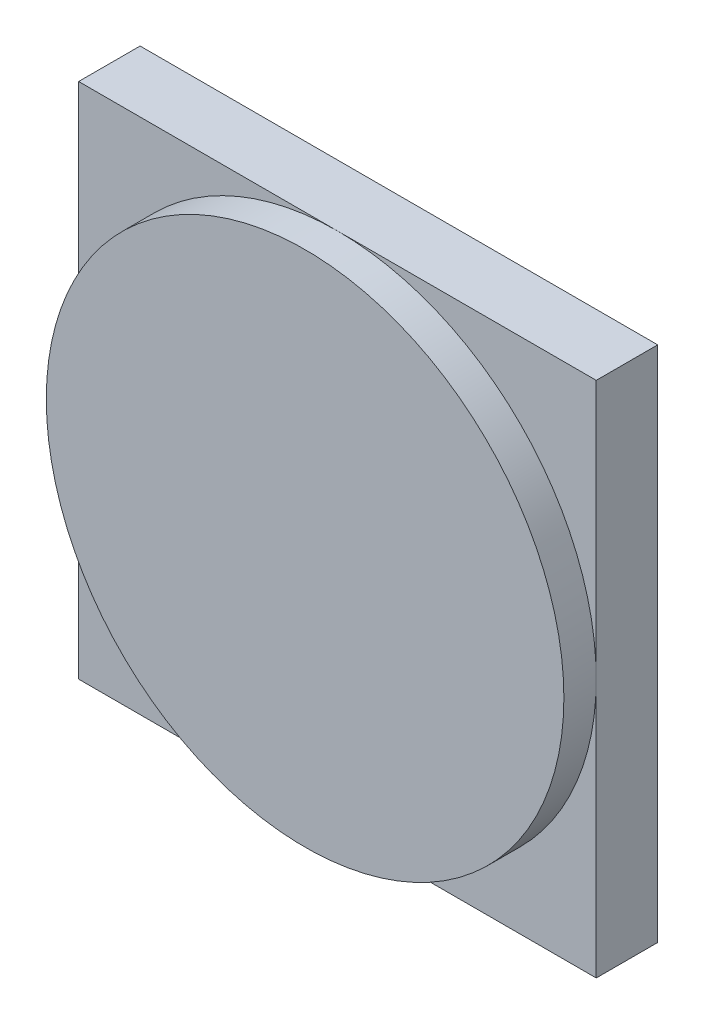
ISO-10303-21;
HEADER;
FILE_DESCRIPTION(('STEP AP214'),'2;1');
FILE_NAME('part.step','',(''),(''),'','','');
FILE_SCHEMA(('AUTOMOTIVE_DESIGN { 1 0 10303 214 1 1 1 1 }'));
ENDSEC;
DATA;
#1=APPLICATION_CONTEXT('core data for automotive mechanical design processes');
#2=APPLICATION_PROTOCOL_DEFINITION('international standard','automotive_design',2000,#1);
#3=PRODUCT_CONTEXT('',#1,'mechanical');
#4=PRODUCT('Part','Part','',(#3));
#5=PRODUCT_RELATED_PRODUCT_CATEGORY('part','',(#4));
#6=PRODUCT_DEFINITION_FORMATION('','',#4);
#7=PRODUCT_DEFINITION_CONTEXT('part definition',#1,'design');
#8=PRODUCT_DEFINITION('design','',#6,#7);
#9=PRODUCT_DEFINITION_SHAPE('','',#8);
#10=(LENGTH_UNIT() NAMED_UNIT(*) SI_UNIT(.MILLI.,.METRE.));
#11=(NAMED_UNIT(*) PLANE_ANGLE_UNIT() SI_UNIT($,.RADIAN.));
#12=(NAMED_UNIT(*) SI_UNIT($,.STERADIAN.) SOLID_ANGLE_UNIT());
#13=UNCERTAINTY_MEASURE_WITH_UNIT(LENGTH_MEASURE(1.E-05),#10,'distance_accuracy_value','');
#14=(GEOMETRIC_REPRESENTATION_CONTEXT(3) GLOBAL_UNCERTAINTY_ASSIGNED_CONTEXT((#13)) GLOBAL_UNIT_ASSIGNED_CONTEXT((#10,
#11,#12)) REPRESENTATION_CONTEXT('',''));
#15=CARTESIAN_POINT('',(0.,0.,0.));
#16=DIRECTION('',(0.,0.,1.));
#17=DIRECTION('',(1.,0.,0.));
#18=AXIS2_PLACEMENT_3D('',#15,#16,#17);
#19=CARTESIAN_POINT('',(0.,0.,5.));
#20=DIRECTION('',(0.,0.,-1.));
#21=DIRECTION('',(-1.,0.,0.));
#22=AXIS2_PLACEMENT_3D('',#19,#20,#21);
#23=CYLINDRICAL_SURFACE('',#22,40.);
#24=CARTESIAN_POINT('',(0.,0.,5.));
#25=DIRECTION('',(0.,0.,1.));
#26=DIRECTION('',(1.,0.,0.));
#27=AXIS2_PLACEMENT_3D('',#24,#25,#26);
#28=CIRCLE('',#27,40.);
#29=CARTESIAN_POINT('',(40.,0.,5.));
#30=VERTEX_POINT('',#29);
#31=EDGE_CURVE('E11',#30,#30,#28,.T.);
#32=ORIENTED_EDGE('',*,*,#31,.F.);
#33=EDGE_LOOP('',(#32));
#34=FACE_BOUND('',#33,.T.);
#35=CARTESIAN_POINT('',(0.,0.,0.));
#36=DIRECTION('',(0.,0.,1.));
#37=DIRECTION('',(1.,0.,0.));
#38=AXIS2_PLACEMENT_3D('',#35,#36,#37);
#39=CIRCLE('',#38,40.);
#40=CARTESIAN_POINT('',(40.,0.,0.));
#41=VERTEX_POINT('',#40);
#42=CARTESIAN_POINT('',(0.,40.,0.));
#43=VERTEX_POINT('',#42);
#44=EDGE_CURVE('E47',#41,#43,#39,.T.);
#45=ORIENTED_EDGE('',*,*,#44,.T.);
#46=CARTESIAN_POINT('',(-40.,0.,0.));
#47=VERTEX_POINT('',#46);
#48=EDGE_CURVE('E66',#43,#47,#39,.T.);
#49=ORIENTED_EDGE('',*,*,#48,.T.);
#50=CARTESIAN_POINT('',(0.,-40.,0.));
#51=VERTEX_POINT('',#50);
#52=EDGE_CURVE('E126',#47,#51,#39,.T.);
#53=ORIENTED_EDGE('',*,*,#52,.T.);
#54=EDGE_CURVE('E123',#51,#41,#39,.T.);
#55=ORIENTED_EDGE('',*,*,#54,.T.);
#56=EDGE_LOOP('',(#45,#49,#53,#55));
#57=FACE_BOUND('',#56,.T.);
#58=ADVANCED_FACE('F44',(#34,#57),#23,.T.);
#59=CARTESIAN_POINT('',(0.,0.,5.));
#60=DIRECTION('',(0.,0.,1.));
#61=DIRECTION('',(1.,0.,0.));
#62=AXIS2_PLACEMENT_3D('',#59,#60,#61);
#63=PLANE('',#62);
#64=ORIENTED_EDGE('',*,*,#31,.T.);
#65=EDGE_LOOP('',(#64));
#66=FACE_BOUND('',#65,.T.);
#67=ADVANCED_FACE('F162',(#66),#63,.T.);
#68=CARTESIAN_POINT('',(0.,0.,0.));
#69=DIRECTION('',(0.,0.,-1.));
#70=DIRECTION('',(-1.,0.,0.));
#71=AXIS2_PLACEMENT_3D('',#68,#69,#70);
#72=PLANE('',#71);
#73=ORIENTED_EDGE('',*,*,#44,.F.);
#74=DIRECTION('',(0.,-1.,0.));
#75=VECTOR('',#74,1.);
#76=CARTESIAN_POINT('',(40.,-40.,0.));
#77=LINE('',#76,#75);
#78=CARTESIAN_POINT('',(40.,40.,0.));
#79=VERTEX_POINT('',#78);
#80=EDGE_CURVE('E58',#79,#41,#77,.T.);
#81=ORIENTED_EDGE('',*,*,#80,.F.);
#82=DIRECTION('',(1.,0.,0.));
#83=VECTOR('',#82,1.);
#84=CARTESIAN_POINT('',(-40.,40.,0.));
#85=LINE('',#84,#83);
#86=EDGE_CURVE('E141',#43,#79,#85,.T.);
#87=ORIENTED_EDGE('',*,*,#86,.F.);
#88=EDGE_LOOP('',(#73,#81,#87));
#89=FACE_BOUND('',#88,.T.);
#90=ADVANCED_FACE('F160',(#89),#72,.F.);
#91=ORIENTED_EDGE('',*,*,#48,.F.);
#92=CARTESIAN_POINT('',(-40.,40.,0.));
#93=VERTEX_POINT('',#92);
#94=EDGE_CURVE('E139',#93,#43,#85,.T.);
#95=ORIENTED_EDGE('',*,*,#94,.F.);
#96=DIRECTION('',(0.,1.,0.));
#97=VECTOR('',#96,1.);
#98=CARTESIAN_POINT('',(-40.,-40.,0.));
#99=LINE('',#98,#97);
#100=EDGE_CURVE('E122',#47,#93,#99,.T.);
#101=ORIENTED_EDGE('',*,*,#100,.F.);
#102=EDGE_LOOP('',(#91,#95,#101));
#103=FACE_BOUND('',#102,.T.);
#104=ADVANCED_FACE('F156',(#103),#72,.F.);
#105=ORIENTED_EDGE('',*,*,#52,.F.);
#106=CARTESIAN_POINT('',(-40.,-40.,0.));
#107=VERTEX_POINT('',#106);
#108=EDGE_CURVE('E142',#107,#47,#99,.T.);
#109=ORIENTED_EDGE('',*,*,#108,.F.);
#110=DIRECTION('',(-1.,0.,0.));
#111=VECTOR('',#110,1.);
#112=CARTESIAN_POINT('',(-40.,-40.,0.));
#113=LINE('',#112,#111);
#114=EDGE_CURVE('E136',#51,#107,#113,.T.);
#115=ORIENTED_EDGE('',*,*,#114,.F.);
#116=EDGE_LOOP('',(#105,#109,#115));
#117=FACE_BOUND('',#116,.T.);
#118=ADVANCED_FACE('F153',(#117),#72,.F.);
#119=CARTESIAN_POINT('',(-40.,-40.,-9.5));
#120=DIRECTION('',(1.,0.,0.));
#121=DIRECTION('',(0.,1.,0.));
#122=AXIS2_PLACEMENT_3D('',#119,#120,#121);
#123=PLANE('',#122);
#124=ORIENTED_EDGE('',*,*,#108,.T.);
#125=ORIENTED_EDGE('',*,*,#100,.T.);
#126=DIRECTION('',(0.,0.,1.));
#127=VECTOR('',#126,1.);
#128=CARTESIAN_POINT('',(-40.,40.,-9.5));
#129=LINE('',#128,#127);
#130=CARTESIAN_POINT('',(-40.,40.,-9.5));
#131=VERTEX_POINT('',#130);
#132=EDGE_CURVE('E104',#131,#93,#129,.T.);
#133=ORIENTED_EDGE('',*,*,#132,.F.);
#134=DIRECTION('',(0.,1.,0.));
#135=VECTOR('',#134,1.);
#136=CARTESIAN_POINT('',(-40.,-40.,-9.5));
#137=LINE('',#136,#135);
#138=CARTESIAN_POINT('',(-40.,-40.,-9.5));
#139=VERTEX_POINT('',#138);
#140=EDGE_CURVE('E109',#139,#131,#137,.T.);
#141=ORIENTED_EDGE('',*,*,#140,.F.);
#142=DIRECTION('',(0.,0.,1.));
#143=VECTOR('',#142,1.);
#144=CARTESIAN_POINT('',(-40.,-40.,-9.5));
#145=LINE('',#144,#143);
#146=EDGE_CURVE('E132',#139,#107,#145,.T.);
#147=ORIENTED_EDGE('',*,*,#146,.T.);
#148=EDGE_LOOP('',(#124,#125,#133,#141,#147));
#149=FACE_BOUND('',#148,.T.);
#150=ADVANCED_FACE('F121',(#149),#123,.F.);
#151=CARTESIAN_POINT('',(-40.,40.,-9.5));
#152=DIRECTION('',(0.,-1.,0.));
#153=DIRECTION('',(0.,0.,-1.));
#154=AXIS2_PLACEMENT_3D('',#151,#152,#153);
#155=PLANE('',#154);
#156=ORIENTED_EDGE('',*,*,#94,.T.);
#157=ORIENTED_EDGE('',*,*,#86,.T.);
#158=DIRECTION('',(0.,0.,1.));
#159=VECTOR('',#158,1.);
#160=CARTESIAN_POINT('',(40.,40.,-9.5));
#161=LINE('',#160,#159);
#162=CARTESIAN_POINT('',(40.,40.,-9.5));
#163=VERTEX_POINT('',#162);
#164=EDGE_CURVE('E105',#163,#79,#161,.T.);
#165=ORIENTED_EDGE('',*,*,#164,.F.);
#166=DIRECTION('',(1.,0.,0.));
#167=VECTOR('',#166,1.);
#168=CARTESIAN_POINT('',(-40.,40.,-9.5));
#169=LINE('',#168,#167);
#170=EDGE_CURVE('E99',#131,#163,#169,.T.);
#171=ORIENTED_EDGE('',*,*,#170,.F.);
#172=ORIENTED_EDGE('',*,*,#132,.T.);
#173=EDGE_LOOP('',(#156,#157,#165,#171,#172));
#174=FACE_BOUND('',#173,.T.);
#175=ADVANCED_FACE('F102',(#174),#155,.F.);
#176=CARTESIAN_POINT('',(40.,-40.,-9.5));
#177=DIRECTION('',(-1.,0.,0.));
#178=DIRECTION('',(0.,-1.,0.));
#179=AXIS2_PLACEMENT_3D('',#176,#177,#178);
#180=PLANE('',#179);
#181=ORIENTED_EDGE('',*,*,#80,.T.);
#182=CARTESIAN_POINT('',(40.,-40.,0.));
#183=VERTEX_POINT('',#182);
#184=EDGE_CURVE('E138',#41,#183,#77,.T.);
#185=ORIENTED_EDGE('',*,*,#184,.T.);
#186=DIRECTION('',(0.,0.,1.));
#187=VECTOR('',#186,1.);
#188=CARTESIAN_POINT('',(40.,-40.,-9.5));
#189=LINE('',#188,#187);
#190=CARTESIAN_POINT('',(40.,-40.,-9.5));
#191=VERTEX_POINT('',#190);
#192=EDGE_CURVE('E127',#191,#183,#189,.T.);
#193=ORIENTED_EDGE('',*,*,#192,.F.);
#194=DIRECTION('',(0.,-1.,0.));
#195=VECTOR('',#194,1.);
#196=CARTESIAN_POINT('',(40.,-40.,-9.5));
#197=LINE('',#196,#195);
#198=EDGE_CURVE('E108',#163,#191,#197,.T.);
#199=ORIENTED_EDGE('',*,*,#198,.F.);
#200=ORIENTED_EDGE('',*,*,#164,.T.);
#201=EDGE_LOOP('',(#181,#185,#193,#199,#200));
#202=FACE_BOUND('',#201,.T.);
#203=ADVANCED_FACE('F146',(#202),#180,.F.);
#204=CARTESIAN_POINT('',(-40.,-40.,-9.5));
#205=DIRECTION('',(0.,1.,0.));
#206=DIRECTION('',(0.,0.,1.));
#207=AXIS2_PLACEMENT_3D('',#204,#205,#206);
#208=PLANE('',#207);
#209=EDGE_CURVE('E118',#183,#51,#113,.T.);
#210=ORIENTED_EDGE('',*,*,#209,.T.);
#211=ORIENTED_EDGE('',*,*,#114,.T.);
#212=ORIENTED_EDGE('',*,*,#146,.F.);
#213=DIRECTION('',(-1.,0.,0.));
#214=VECTOR('',#213,1.);
#215=CARTESIAN_POINT('',(-40.,-40.,-9.5));
#216=LINE('',#215,#214);
#217=EDGE_CURVE('E114',#191,#139,#216,.T.);
#218=ORIENTED_EDGE('',*,*,#217,.F.);
#219=ORIENTED_EDGE('',*,*,#192,.T.);
#220=EDGE_LOOP('',(#210,#211,#212,#218,#219));
#221=FACE_BOUND('',#220,.T.);
#222=ADVANCED_FACE('F149',(#221),#208,.F.);
#223=CARTESIAN_POINT('',(0.,0.,-9.5));
#224=DIRECTION('',(0.,0.,-1.));
#225=DIRECTION('',(-1.,0.,0.));
#226=AXIS2_PLACEMENT_3D('',#223,#224,#225);
#227=PLANE('',#226);
#228=ORIENTED_EDGE('',*,*,#140,.T.);
#229=ORIENTED_EDGE('',*,*,#170,.T.);
#230=ORIENTED_EDGE('',*,*,#198,.T.);
#231=ORIENTED_EDGE('',*,*,#217,.T.);
#232=EDGE_LOOP('',(#228,#229,#230,#231));
#233=FACE_BOUND('',#232,.T.);
#234=ADVANCED_FACE('F112',(#233),#227,.T.);
#235=ORIENTED_EDGE('',*,*,#54,.F.);
#236=ORIENTED_EDGE('',*,*,#209,.F.);
#237=ORIENTED_EDGE('',*,*,#184,.F.);
#238=EDGE_LOOP('',(#235,#236,#237));
#239=FACE_BOUND('',#238,.T.);
#240=ADVANCED_FACE('F164',(#239),#72,.F.);
#241=CLOSED_SHELL('',(#58,#67,#90,#104,#118,#150,#175,#203,#222,#234,#240));
#242=MANIFOLD_SOLID_BREP('B2',#241);
#243=ADVANCED_BREP_SHAPE_REPRESENTATION('',(#18,#242),#14);
#244=SHAPE_DEFINITION_REPRESENTATION(#9,#243);
ENDSEC;
END-ISO-10303-21;
